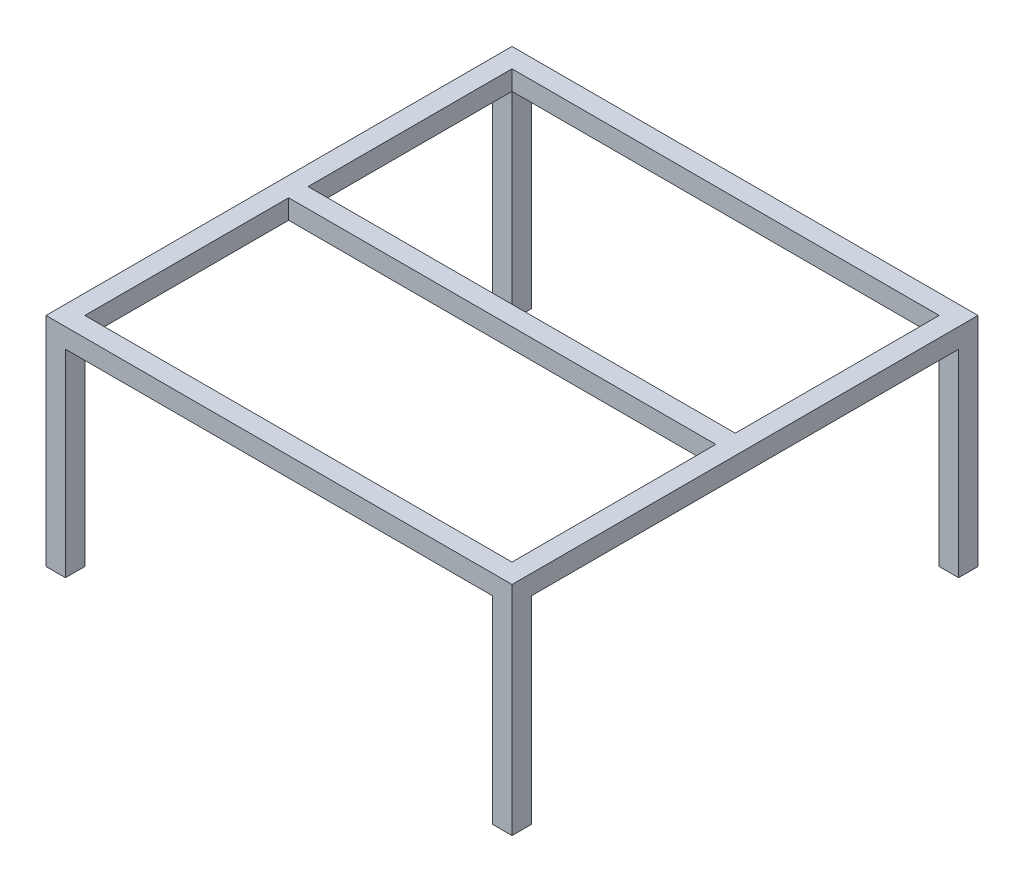
ISO-10303-21;
HEADER;
FILE_DESCRIPTION(('STEP AP214'),'2;1');
FILE_NAME('part.step','',(''),(''),'','','');
FILE_SCHEMA(('AUTOMOTIVE_DESIGN { 1 0 10303 214 1 1 1 1 }'));
ENDSEC;
DATA;
#1=APPLICATION_CONTEXT('core data for automotive mechanical design processes');
#2=APPLICATION_PROTOCOL_DEFINITION('international standard','automotive_design',2000,#1);
#3=PRODUCT_CONTEXT('',#1,'mechanical');
#4=PRODUCT('Part','Part','',(#3));
#5=PRODUCT_RELATED_PRODUCT_CATEGORY('part','',(#4));
#6=PRODUCT_DEFINITION_FORMATION('','',#4);
#7=PRODUCT_DEFINITION_CONTEXT('part definition',#1,'design');
#8=PRODUCT_DEFINITION('design','',#6,#7);
#9=PRODUCT_DEFINITION_SHAPE('','',#8);
#10=(LENGTH_UNIT() NAMED_UNIT(*) SI_UNIT(.MILLI.,.METRE.));
#11=(NAMED_UNIT(*) PLANE_ANGLE_UNIT() SI_UNIT($,.RADIAN.));
#12=(NAMED_UNIT(*) SI_UNIT($,.STERADIAN.) SOLID_ANGLE_UNIT());
#13=UNCERTAINTY_MEASURE_WITH_UNIT(LENGTH_MEASURE(1.E-05),#10,'distance_accuracy_value','');
#14=(GEOMETRIC_REPRESENTATION_CONTEXT(3) GLOBAL_UNCERTAINTY_ASSIGNED_CONTEXT((#13)) GLOBAL_UNIT_ASSIGNED_CONTEXT((#10,
#11,#12)) REPRESENTATION_CONTEXT('',''));
#15=CARTESIAN_POINT('',(0.,0.,0.));
#16=DIRECTION('',(0.,0.,1.));
#17=DIRECTION('',(1.,0.,0.));
#18=AXIS2_PLACEMENT_3D('',#15,#16,#17);
#19=CARTESIAN_POINT('',(0.,11.43,0.));
#20=DIRECTION('',(0.,1.,0.));
#21=DIRECTION('',(0.,0.,1.));
#22=AXIS2_PLACEMENT_3D('',#19,#20,#21);
#23=PLANE('',#22);
#24=CARTESIAN_POINT('',(-32.24841603699,11.43,27.6628605629459));
#25=DIRECTION('',(0.,-1.,0.));
#26=DIRECTION('',(0.,0.,-1.));
#27=AXIS2_PLACEMENT_3D('',#24,#25,#26);
#28=CIRCLE('',#27,1.59512);
#29=CARTESIAN_POINT('',(-32.24841603699,11.43,26.067740562946));
#30=VERTEX_POINT('',#29);
#31=EDGE_CURVE('E525',#30,#30,#28,.T.);
#32=ORIENTED_EDGE('',*,*,#31,.F.);
#33=EDGE_LOOP('',(#32));
#34=FACE_BOUND('',#33,.T.);
#35=DIRECTION('',(1.,0.,0.));
#36=VECTOR('',#35,1.);
#37=CARTESIAN_POINT('',(-35.4234160369899,11.43,30.8378605629459));
#38=LINE('',#37,#36);
#39=CARTESIAN_POINT('',(-35.4234160369899,11.43,30.8378605629459));
#40=VERTEX_POINT('',#39);
#41=CARTESIAN_POINT('',(-29.07341603699,11.43,30.8378605629459));
#42=VERTEX_POINT('',#41);
#43=EDGE_CURVE('E414',#40,#42,#38,.T.);
#44=ORIENTED_EDGE('',*,*,#43,.F.);
#45=DIRECTION('',(0.,0.,1.));
#46=VECTOR('',#45,1.);
#47=CARTESIAN_POINT('',(-35.42341603699,11.43,-121.562139437054));
#48=LINE('',#47,#46);
#49=CARTESIAN_POINT('',(-35.4234160369899,11.43,24.4878605629459));
#50=VERTEX_POINT('',#49);
#51=EDGE_CURVE('E398',#50,#40,#48,.T.);
#52=ORIENTED_EDGE('',*,*,#51,.F.);
#53=DIRECTION('',(-1.,0.,0.));
#54=VECTOR('',#53,1.);
#55=CARTESIAN_POINT('',(-35.4234160369899,11.43,24.4878605629459));
#56=LINE('',#55,#54);
#57=CARTESIAN_POINT('',(-29.07341603699,11.43,24.4878605629459));
#58=VERTEX_POINT('',#57);
#59=EDGE_CURVE('E402',#58,#50,#56,.T.);
#60=ORIENTED_EDGE('',*,*,#59,.F.);
#61=DIRECTION('',(0.,0.,-1.));
#62=VECTOR('',#61,1.);
#63=CARTESIAN_POINT('',(-29.07341603699,11.43,30.8378605629459));
#64=LINE('',#63,#62);
#65=EDGE_CURVE('E42',#42,#58,#64,.T.);
#66=ORIENTED_EDGE('',*,*,#65,.F.);
#67=EDGE_LOOP('',(#44,#52,#60,#66));
#68=FACE_BOUND('',#67,.T.);
#69=ADVANCED_FACE('F39',(#34,#68),#23,.F.);
#70=CARTESIAN_POINT('',(113.80158396301,11.43,27.662860562946));
#71=DIRECTION('',(0.,-1.,0.));
#72=DIRECTION('',(0.,0.,-1.));
#73=AXIS2_PLACEMENT_3D('',#70,#71,#72);
#74=CIRCLE('',#73,1.59512);
#75=CARTESIAN_POINT('',(113.80158396301,11.43,26.0677405629459));
#76=VERTEX_POINT('',#75);
#77=EDGE_CURVE('E549',#76,#76,#74,.T.);
#78=ORIENTED_EDGE('',*,*,#77,.F.);
#79=EDGE_LOOP('',(#78));
#80=FACE_BOUND('',#79,.T.);
#81=DIRECTION('',(-1.,0.,0.));
#82=VECTOR('',#81,1.);
#83=CARTESIAN_POINT('',(116.97658396301,11.43,24.487860562946));
#84=LINE('',#83,#82);
#85=CARTESIAN_POINT('',(116.97658396301,11.43,24.487860562946));
#86=VERTEX_POINT('',#85);
#87=CARTESIAN_POINT('',(110.62658396301,11.43,24.487860562946));
#88=VERTEX_POINT('',#87);
#89=EDGE_CURVE('E403',#86,#88,#84,.T.);
#90=ORIENTED_EDGE('',*,*,#89,.F.);
#91=DIRECTION('',(0.,0.,-1.));
#92=VECTOR('',#91,1.);
#93=CARTESIAN_POINT('',(116.97658396301,11.43,-121.562139437054));
#94=LINE('',#93,#92);
#95=CARTESIAN_POINT('',(116.97658396301,11.43,30.8378605629459));
#96=VERTEX_POINT('',#95);
#97=EDGE_CURVE('E407',#96,#86,#94,.T.);
#98=ORIENTED_EDGE('',*,*,#97,.F.);
#99=CARTESIAN_POINT('',(110.62658396301,11.43,30.8378605629459));
#100=VERTEX_POINT('',#99);
#101=EDGE_CURVE('E410',#100,#96,#38,.T.);
#102=ORIENTED_EDGE('',*,*,#101,.F.);
#103=DIRECTION('',(0.,0.,1.));
#104=VECTOR('',#103,1.);
#105=CARTESIAN_POINT('',(110.62658396301,11.43,30.8378605629459));
#106=LINE('',#105,#104);
#107=EDGE_CURVE('E406',#88,#100,#106,.T.);
#108=ORIENTED_EDGE('',*,*,#107,.F.);
#109=EDGE_LOOP('',(#90,#98,#102,#108));
#110=FACE_BOUND('',#109,.T.);
#111=ADVANCED_FACE('F566',(#80,#110),#23,.F.);
#112=CARTESIAN_POINT('',(113.80158396301,11.43,-118.387139437054));
#113=DIRECTION('',(0.,-1.,0.));
#114=DIRECTION('',(0.,0.,-1.));
#115=AXIS2_PLACEMENT_3D('',#112,#113,#114);
#116=CIRCLE('',#115,1.59512);
#117=CARTESIAN_POINT('',(113.80158396301,11.43,-119.982259437054));
#118=VERTEX_POINT('',#117);
#119=EDGE_CURVE('E541',#118,#118,#116,.T.);
#120=ORIENTED_EDGE('',*,*,#119,.F.);
#121=EDGE_LOOP('',(#120));
#122=FACE_BOUND('',#121,.T.);
#123=DIRECTION('',(-1.,0.,0.));
#124=VECTOR('',#123,1.);
#125=CARTESIAN_POINT('',(-35.42341603699,11.43,-121.562139437054));
#126=LINE('',#125,#124);
#127=CARTESIAN_POINT('',(116.97658396301,11.43,-121.562139437054));
#128=VERTEX_POINT('',#127);
#129=CARTESIAN_POINT('',(110.62658396301,11.43,-121.562139437054));
#130=VERTEX_POINT('',#129);
#131=EDGE_CURVE('E393',#128,#130,#126,.T.);
#132=ORIENTED_EDGE('',*,*,#131,.F.);
#133=CARTESIAN_POINT('',(116.97658396301,11.43,-115.212139437054));
#134=VERTEX_POINT('',#133);
#135=EDGE_CURVE('E411',#134,#128,#94,.T.);
#136=ORIENTED_EDGE('',*,*,#135,.F.);
#137=DIRECTION('',(1.,0.,0.));
#138=VECTOR('',#137,1.);
#139=CARTESIAN_POINT('',(116.97658396301,11.43,-115.212139437054));
#140=LINE('',#139,#138);
#141=CARTESIAN_POINT('',(110.62658396301,11.43,-115.212139437054));
#142=VERTEX_POINT('',#141);
#143=EDGE_CURVE('E397',#142,#134,#140,.T.);
#144=ORIENTED_EDGE('',*,*,#143,.F.);
#145=DIRECTION('',(0.,0.,1.));
#146=VECTOR('',#145,1.);
#147=CARTESIAN_POINT('',(110.62658396301,11.43,30.8378605629459));
#148=LINE('',#147,#146);
#149=EDGE_CURVE('E11',#130,#142,#148,.T.);
#150=ORIENTED_EDGE('',*,*,#149,.F.);
#151=EDGE_LOOP('',(#132,#136,#144,#150));
#152=FACE_BOUND('',#151,.T.);
#153=ADVANCED_FACE('F569',(#122,#152),#23,.F.);
#154=CARTESIAN_POINT('',(-32.24841603699,11.43,-118.387139437054));
#155=DIRECTION('',(0.,-1.,0.));
#156=DIRECTION('',(0.,0.,-1.));
#157=AXIS2_PLACEMENT_3D('',#154,#155,#156);
#158=CIRCLE('',#157,1.59512);
#159=CARTESIAN_POINT('',(-32.24841603699,11.43,-119.982259437054));
#160=VERTEX_POINT('',#159);
#161=EDGE_CURVE('E533',#160,#160,#158,.T.);
#162=ORIENTED_EDGE('',*,*,#161,.F.);
#163=EDGE_LOOP('',(#162));
#164=FACE_BOUND('',#163,.T.);
#165=DIRECTION('',(1.,0.,0.));
#166=VECTOR('',#165,1.);
#167=CARTESIAN_POINT('',(-35.42341603699,11.43,-115.212139437054));
#168=LINE('',#167,#166);
#169=CARTESIAN_POINT('',(-35.42341603699,11.43,-115.212139437054));
#170=VERTEX_POINT('',#169);
#171=CARTESIAN_POINT('',(-29.07341603699,11.43,-115.212139437054));
#172=VERTEX_POINT('',#171);
#173=EDGE_CURVE('E399',#170,#172,#168,.T.);
#174=ORIENTED_EDGE('',*,*,#173,.F.);
#175=CARTESIAN_POINT('',(-35.42341603699,11.43,-121.562139437054));
#176=VERTEX_POINT('',#175);
#177=EDGE_CURVE('E394',#176,#170,#48,.T.);
#178=ORIENTED_EDGE('',*,*,#177,.F.);
#179=CARTESIAN_POINT('',(-29.07341603699,11.43,-121.562139437054));
#180=VERTEX_POINT('',#179);
#181=EDGE_CURVE('E390',#180,#176,#126,.T.);
#182=ORIENTED_EDGE('',*,*,#181,.F.);
#183=DIRECTION('',(0.,0.,-1.));
#184=VECTOR('',#183,1.);
#185=CARTESIAN_POINT('',(-29.07341603699,11.43,30.8378605629459));
#186=LINE('',#185,#184);
#187=EDGE_CURVE('E48',#172,#180,#186,.T.);
#188=ORIENTED_EDGE('',*,*,#187,.F.);
#189=EDGE_LOOP('',(#174,#178,#182,#188));
#190=FACE_BOUND('',#189,.T.);
#191=ADVANCED_FACE('F577',(#164,#190),#23,.F.);
#192=CARTESIAN_POINT('',(-29.07341603699,82.55,30.8378605629459));
#193=DIRECTION('',(-1.,0.,0.));
#194=DIRECTION('',(0.,0.,1.));
#195=AXIS2_PLACEMENT_3D('',#192,#193,#194);
#196=PLANE('',#195);
#197=DIRECTION('',(0.,1.,0.));
#198=VECTOR('',#197,1.);
#199=CARTESIAN_POINT('',(-29.07341603699,82.55,-48.5220858432598));
#200=LINE('',#199,#198);
#201=CARTESIAN_POINT('',(-29.07341603699,76.1659043542835,-48.5220858432598));
#202=VERTEX_POINT('',#201);
#203=CARTESIAN_POINT('',(-29.07341603699,82.55,-48.5220858432598));
#204=VERTEX_POINT('',#203);
#205=EDGE_CURVE('E213',#202,#204,#200,.T.);
#206=ORIENTED_EDGE('',*,*,#205,.F.);
#207=DIRECTION('',(0.,0.,1.));
#208=VECTOR('',#207,1.);
#209=CARTESIAN_POINT('',(-29.07341603699,76.1659043542835,-115.212139437054));
#210=LINE('',#209,#208);
#211=CARTESIAN_POINT('',(-29.07341603699,76.1659043542835,-115.212139437054));
#212=VERTEX_POINT('',#211);
#213=EDGE_CURVE('E289',#212,#202,#210,.T.);
#214=ORIENTED_EDGE('',*,*,#213,.F.);
#215=DIRECTION('',(0.,-1.,0.));
#216=VECTOR('',#215,1.);
#217=CARTESIAN_POINT('',(-29.07341603699,82.55,-115.212139437054));
#218=LINE('',#217,#216);
#219=CARTESIAN_POINT('',(-29.07341603699,82.55,-115.212139437054));
#220=VERTEX_POINT('',#219);
#221=EDGE_CURVE('E219',#220,#212,#218,.T.);
#222=ORIENTED_EDGE('',*,*,#221,.F.);
#223=DIRECTION('',(0.,0.,-1.));
#224=VECTOR('',#223,1.);
#225=CARTESIAN_POINT('',(-29.07341603699,82.55,30.8378605629459));
#226=LINE('',#225,#224);
#227=EDGE_CURVE('E334',#204,#220,#226,.T.);
#228=ORIENTED_EDGE('',*,*,#227,.F.);
#229=EDGE_LOOP('',(#206,#214,#222,#228));
#230=FACE_BOUND('',#229,.T.);
#231=ADVANCED_FACE('F512',(#230),#196,.F.);
#232=CARTESIAN_POINT('',(110.62658396301,82.55,-48.5220858432598));
#233=DIRECTION('',(0.,0.,1.));
#234=DIRECTION('',(1.,0.,0.));
#235=AXIS2_PLACEMENT_3D('',#232,#233,#234);
#236=PLANE('',#235);
#237=ORIENTED_EDGE('',*,*,#205,.T.);
#238=DIRECTION('',(-1.,0.,0.));
#239=VECTOR('',#238,1.);
#240=CARTESIAN_POINT('',(110.62658396301,82.55,-48.5220858432598));
#241=LINE('',#240,#239);
#242=CARTESIAN_POINT('',(110.62658396301,82.55,-48.5220858432598));
#243=VERTEX_POINT('',#242);
#244=EDGE_CURVE('E226',#243,#204,#241,.T.);
#245=ORIENTED_EDGE('',*,*,#244,.F.);
#246=DIRECTION('',(0.,1.,0.));
#247=VECTOR('',#246,1.);
#248=CARTESIAN_POINT('',(110.62658396301,82.55,-48.5220858432598));
#249=LINE('',#248,#247);
#250=CARTESIAN_POINT('',(110.62658396301,76.1659043542835,-48.5220858432598));
#251=VERTEX_POINT('',#250);
#252=EDGE_CURVE('E212',#251,#243,#249,.T.);
#253=ORIENTED_EDGE('',*,*,#252,.F.);
#254=DIRECTION('',(-1.,0.,0.));
#255=VECTOR('',#254,1.);
#256=CARTESIAN_POINT('',(110.62658396301,76.1659043542835,-48.5220858432598));
#257=LINE('',#256,#255);
#258=EDGE_CURVE('E220',#251,#202,#257,.T.);
#259=ORIENTED_EDGE('',*,*,#258,.T.);
#260=EDGE_LOOP('',(#237,#245,#253,#259));
#261=FACE_BOUND('',#260,.T.);
#262=ADVANCED_FACE('F584',(#261),#236,.F.);
#263=CARTESIAN_POINT('',(110.62658396301,82.55,30.8378605629459));
#264=DIRECTION('',(1.,0.,0.));
#265=DIRECTION('',(0.,0.,-1.));
#266=AXIS2_PLACEMENT_3D('',#263,#264,#265);
#267=PLANE('',#266);
#268=ORIENTED_EDGE('',*,*,#252,.T.);
#269=DIRECTION('',(0.,0.,1.));
#270=VECTOR('',#269,1.);
#271=CARTESIAN_POINT('',(110.62658396301,82.55,30.8378605629459));
#272=LINE('',#271,#270);
#273=CARTESIAN_POINT('',(110.62658396301,82.55,-115.212139437054));
#274=VERTEX_POINT('',#273);
#275=EDGE_CURVE('E354',#274,#243,#272,.T.);
#276=ORIENTED_EDGE('',*,*,#275,.F.);
#277=DIRECTION('',(0.,-1.,0.));
#278=VECTOR('',#277,1.);
#279=CARTESIAN_POINT('',(110.62658396301,82.55,-115.212139437054));
#280=LINE('',#279,#278);
#281=CARTESIAN_POINT('',(110.62658396301,76.1659043542835,-115.212139437054));
#282=VERTEX_POINT('',#281);
#283=EDGE_CURVE('E230',#274,#282,#280,.T.);
#284=ORIENTED_EDGE('',*,*,#283,.T.);
#285=DIRECTION('',(0.,0.,1.));
#286=VECTOR('',#285,1.);
#287=CARTESIAN_POINT('',(110.62658396301,76.1659043542835,-115.212139437054));
#288=LINE('',#287,#286);
#289=EDGE_CURVE('E202',#282,#251,#288,.T.);
#290=ORIENTED_EDGE('',*,*,#289,.T.);
#291=EDGE_LOOP('',(#268,#276,#284,#290));
#292=FACE_BOUND('',#291,.T.);
#293=ADVANCED_FACE('F460',(#292),#267,.F.);
#294=DIRECTION('',(0.,-1.,0.));
#295=VECTOR('',#294,1.);
#296=CARTESIAN_POINT('',(-29.07341603699,82.55,-42.1720858432598));
#297=LINE('',#296,#295);
#298=CARTESIAN_POINT('',(-29.07341603699,82.55,-42.1720858432598));
#299=VERTEX_POINT('',#298);
#300=CARTESIAN_POINT('',(-29.07341603699,76.1659043542835,-42.1720858432598));
#301=VERTEX_POINT('',#300);
#302=EDGE_CURVE('E217',#299,#301,#297,.T.);
#303=ORIENTED_EDGE('',*,*,#302,.F.);
#304=CARTESIAN_POINT('',(-29.07341603699,82.55,24.487860562946));
#305=VERTEX_POINT('',#304);
#306=EDGE_CURVE('E335',#305,#299,#226,.T.);
#307=ORIENTED_EDGE('',*,*,#306,.F.);
#308=DIRECTION('',(0.,1.,0.));
#309=VECTOR('',#308,1.);
#310=CARTESIAN_POINT('',(-29.07341603699,82.55,24.487860562946));
#311=LINE('',#310,#309);
#312=CARTESIAN_POINT('',(-29.07341603699,76.1659043542835,24.487860562946));
#313=VERTEX_POINT('',#312);
#314=EDGE_CURVE('E258',#313,#305,#311,.T.);
#315=ORIENTED_EDGE('',*,*,#314,.F.);
#316=EDGE_CURVE('E288',#301,#313,#210,.T.);
#317=ORIENTED_EDGE('',*,*,#316,.F.);
#318=EDGE_LOOP('',(#303,#307,#315,#317));
#319=FACE_BOUND('',#318,.T.);
#320=ADVANCED_FACE('F496',(#319),#196,.F.);
#321=CARTESIAN_POINT('',(110.62658396301,82.55,24.487860562946));
#322=DIRECTION('',(0.,0.,1.));
#323=DIRECTION('',(1.,0.,0.));
#324=AXIS2_PLACEMENT_3D('',#321,#322,#323);
#325=PLANE('',#324);
#326=ORIENTED_EDGE('',*,*,#314,.T.);
#327=DIRECTION('',(-1.,0.,0.));
#328=VECTOR('',#327,1.);
#329=CARTESIAN_POINT('',(110.62658396301,82.55,24.487860562946));
#330=LINE('',#329,#328);
#331=CARTESIAN_POINT('',(110.62658396301,82.55,24.487860562946));
#332=VERTEX_POINT('',#331);
#333=EDGE_CURVE('E261',#332,#305,#330,.T.);
#334=ORIENTED_EDGE('',*,*,#333,.F.);
#335=DIRECTION('',(0.,1.,0.));
#336=VECTOR('',#335,1.);
#337=CARTESIAN_POINT('',(110.62658396301,82.55,24.487860562946));
#338=LINE('',#337,#336);
#339=CARTESIAN_POINT('',(110.62658396301,76.1659043542835,24.487860562946));
#340=VERTEX_POINT('',#339);
#341=EDGE_CURVE('E257',#340,#332,#338,.T.);
#342=ORIENTED_EDGE('',*,*,#341,.F.);
#343=DIRECTION('',(-1.,0.,0.));
#344=VECTOR('',#343,1.);
#345=CARTESIAN_POINT('',(110.62658396301,76.1659043542835,24.487860562946));
#346=LINE('',#345,#344);
#347=EDGE_CURVE('E270',#340,#313,#346,.T.);
#348=ORIENTED_EDGE('',*,*,#347,.T.);
#349=EDGE_LOOP('',(#326,#334,#342,#348));
#350=FACE_BOUND('',#349,.T.);
#351=ADVANCED_FACE('F492',(#350),#325,.F.);
#352=DIRECTION('',(0.,-1.,0.));
#353=VECTOR('',#352,1.);
#354=CARTESIAN_POINT('',(110.62658396301,82.55,-42.1720858432598));
#355=LINE('',#354,#353);
#356=CARTESIAN_POINT('',(110.62658396301,82.55,-42.1720858432598));
#357=VERTEX_POINT('',#356);
#358=CARTESIAN_POINT('',(110.62658396301,76.1659043542835,-42.1720858432598));
#359=VERTEX_POINT('',#358);
#360=EDGE_CURVE('E206',#357,#359,#355,.T.);
#361=ORIENTED_EDGE('',*,*,#360,.T.);
#362=EDGE_CURVE('E189',#359,#340,#288,.T.);
#363=ORIENTED_EDGE('',*,*,#362,.T.);
#364=ORIENTED_EDGE('',*,*,#341,.T.);
#365=EDGE_CURVE('E208',#357,#332,#272,.T.);
#366=ORIENTED_EDGE('',*,*,#365,.F.);
#367=EDGE_LOOP('',(#361,#363,#364,#366));
#368=FACE_BOUND('',#367,.T.);
#369=ADVANCED_FACE('F207',(#368),#267,.F.);
#370=CARTESIAN_POINT('',(110.62658396301,82.55,-42.1720858432598));
#371=DIRECTION('',(0.,0.,-1.));
#372=DIRECTION('',(0.,1.,0.));
#373=AXIS2_PLACEMENT_3D('',#370,#371,#372);
#374=PLANE('',#373);
#375=ORIENTED_EDGE('',*,*,#302,.T.);
#376=DIRECTION('',(-1.,0.,0.));
#377=VECTOR('',#376,1.);
#378=CARTESIAN_POINT('',(110.62658396301,76.1659043542835,-42.1720858432598));
#379=LINE('',#378,#377);
#380=EDGE_CURVE('E193',#359,#301,#379,.T.);
#381=ORIENTED_EDGE('',*,*,#380,.F.);
#382=ORIENTED_EDGE('',*,*,#360,.F.);
#383=DIRECTION('',(-1.,0.,0.));
#384=VECTOR('',#383,1.);
#385=CARTESIAN_POINT('',(110.62658396301,82.55,-42.1720858432598));
#386=LINE('',#385,#384);
#387=EDGE_CURVE('E500',#357,#299,#386,.T.);
#388=ORIENTED_EDGE('',*,*,#387,.T.);
#389=EDGE_LOOP('',(#375,#381,#382,#388));
#390=FACE_BOUND('',#389,.T.);
#391=ADVANCED_FACE('F215',(#390),#374,.F.);
#392=CARTESIAN_POINT('',(110.62658396301,82.55,-115.212139437054));
#393=DIRECTION('',(0.,0.,-1.));
#394=DIRECTION('',(-1.,0.,0.));
#395=AXIS2_PLACEMENT_3D('',#392,#393,#394);
#396=PLANE('',#395);
#397=ORIENTED_EDGE('',*,*,#221,.T.);
#398=DIRECTION('',(-1.,0.,0.));
#399=VECTOR('',#398,1.);
#400=CARTESIAN_POINT('',(110.62658396301,76.1659043542835,-115.212139437054));
#401=LINE('',#400,#399);
#402=EDGE_CURVE('E244',#282,#212,#401,.T.);
#403=ORIENTED_EDGE('',*,*,#402,.F.);
#404=ORIENTED_EDGE('',*,*,#283,.F.);
#405=DIRECTION('',(-1.,0.,0.));
#406=VECTOR('',#405,1.);
#407=CARTESIAN_POINT('',(110.62658396301,82.55,-115.212139437054));
#408=LINE('',#407,#406);
#409=EDGE_CURVE('E248',#274,#220,#408,.T.);
#410=ORIENTED_EDGE('',*,*,#409,.T.);
#411=EDGE_LOOP('',(#397,#403,#404,#410));
#412=FACE_BOUND('',#411,.T.);
#413=ADVANCED_FACE('F511',(#412),#396,.F.);
#414=CARTESIAN_POINT('',(-35.4234160369899,82.55,24.4878605629459));
#415=DIRECTION('',(0.,0.,1.));
#416=DIRECTION('',(1.,0.,0.));
#417=AXIS2_PLACEMENT_3D('',#414,#415,#416);
#418=PLANE('',#417);
#419=DIRECTION('',(0.,-1.,0.));
#420=VECTOR('',#419,1.);
#421=CARTESIAN_POINT('',(-29.07341603699,82.55,24.4878605629459));
#422=LINE('',#421,#420);
#423=EDGE_CURVE('E343',#313,#58,#422,.T.);
#424=ORIENTED_EDGE('',*,*,#423,.T.);
#425=ORIENTED_EDGE('',*,*,#59,.T.);
#426=DIRECTION('',(0.,-1.,0.));
#427=VECTOR('',#426,1.);
#428=CARTESIAN_POINT('',(-35.4234160369899,82.55,24.4878605629459));
#429=LINE('',#428,#427);
#430=CARTESIAN_POINT('',(-35.4234160369899,76.1659043542835,24.487860562946));
#431=VERTEX_POINT('',#430);
#432=EDGE_CURVE('E339',#431,#50,#429,.T.);
#433=ORIENTED_EDGE('',*,*,#432,.F.);
#434=DIRECTION('',(-1.,0.,0.));
#435=VECTOR('',#434,1.);
#436=CARTESIAN_POINT('',(-29.07341603699,76.1659043542835,24.487860562946));
#437=LINE('',#436,#435);
#438=EDGE_CURVE('E277',#313,#431,#437,.T.);
#439=ORIENTED_EDGE('',*,*,#438,.F.);
#440=EDGE_LOOP('',(#424,#425,#433,#439));
#441=FACE_BOUND('',#440,.T.);
#442=ADVANCED_FACE('F427',(#441),#418,.F.);
#443=CARTESIAN_POINT('',(-35.42341603699,82.55,-115.212139437054));
#444=DIRECTION('',(0.,0.,-1.));
#445=DIRECTION('',(-1.,0.,0.));
#446=AXIS2_PLACEMENT_3D('',#443,#444,#445);
#447=PLANE('',#446);
#448=DIRECTION('',(0.,-1.,0.));
#449=VECTOR('',#448,1.);
#450=CARTESIAN_POINT('',(-35.42341603699,82.55,-115.212139437054));
#451=LINE('',#450,#449);
#452=CARTESIAN_POINT('',(-35.4234160369899,76.1659043542835,-115.212139437054));
#453=VERTEX_POINT('',#452);
#454=EDGE_CURVE('E326',#453,#170,#451,.T.);
#455=ORIENTED_EDGE('',*,*,#454,.T.);
#456=ORIENTED_EDGE('',*,*,#173,.T.);
#457=DIRECTION('',(0.,-1.,0.));
#458=VECTOR('',#457,1.);
#459=CARTESIAN_POINT('',(-29.07341603699,82.55,-115.212139437054));
#460=LINE('',#459,#458);
#461=EDGE_CURVE('E322',#212,#172,#460,.T.);
#462=ORIENTED_EDGE('',*,*,#461,.F.);
#463=DIRECTION('',(-1.,0.,0.));
#464=VECTOR('',#463,1.);
#465=CARTESIAN_POINT('',(-29.07341603699,76.1659043542835,-115.212139437054));
#466=LINE('',#465,#464);
#467=EDGE_CURVE('E278',#212,#453,#466,.T.);
#468=ORIENTED_EDGE('',*,*,#467,.T.);
#469=EDGE_LOOP('',(#455,#456,#462,#468));
#470=FACE_BOUND('',#469,.T.);
#471=ADVANCED_FACE('F440',(#470),#447,.F.);
#472=DIRECTION('',(0.,-1.,0.));
#473=VECTOR('',#472,1.);
#474=CARTESIAN_POINT('',(110.62658396301,82.55,24.487860562946));
#475=LINE('',#474,#473);
#476=EDGE_CURVE('E366',#340,#88,#475,.T.);
#477=ORIENTED_EDGE('',*,*,#476,.T.);
#478=ORIENTED_EDGE('',*,*,#107,.T.);
#479=DIRECTION('',(0.,-1.,0.));
#480=VECTOR('',#479,1.);
#481=CARTESIAN_POINT('',(110.62658396301,82.55,30.8378605629459));
#482=LINE('',#481,#480);
#483=CARTESIAN_POINT('',(110.62658396301,76.1659043542835,30.8378605629459));
#484=VERTEX_POINT('',#483);
#485=EDGE_CURVE('E362',#484,#100,#482,.T.);
#486=ORIENTED_EDGE('',*,*,#485,.F.);
#487=DIRECTION('',(0.,0.,-1.));
#488=VECTOR('',#487,1.);
#489=CARTESIAN_POINT('',(110.62658396301,76.1659043542835,30.8378605629459));
#490=LINE('',#489,#488);
#491=EDGE_CURVE('E253',#484,#340,#490,.T.);
#492=ORIENTED_EDGE('',*,*,#491,.T.);
#493=EDGE_LOOP('',(#477,#478,#486,#492));
#494=FACE_BOUND('',#493,.T.);
#495=ADVANCED_FACE('F478',(#494),#267,.F.);
#496=CARTESIAN_POINT('',(110.62658396301,76.1659043542835,30.8378605629459));
#497=DIRECTION('',(0.,1.,0.));
#498=DIRECTION('',(0.,0.,1.));
#499=AXIS2_PLACEMENT_3D('',#496,#497,#498);
#500=PLANE('',#499);
#501=DIRECTION('',(0.,0.,-1.));
#502=VECTOR('',#501,1.);
#503=CARTESIAN_POINT('',(-29.07341603699,76.1659043542835,30.8378605629459));
#504=LINE('',#503,#502);
#505=CARTESIAN_POINT('',(-29.07341603699,76.1659043542835,30.8378605629459));
#506=VERTEX_POINT('',#505);
#507=EDGE_CURVE('E252',#506,#313,#504,.T.);
#508=ORIENTED_EDGE('',*,*,#507,.T.);
#509=ORIENTED_EDGE('',*,*,#347,.F.);
#510=ORIENTED_EDGE('',*,*,#491,.F.);
#511=DIRECTION('',(-1.,0.,0.));
#512=VECTOR('',#511,1.);
#513=CARTESIAN_POINT('',(110.62658396301,76.1659043542835,30.8378605629459));
#514=LINE('',#513,#512);
#515=EDGE_CURVE('E274',#484,#506,#514,.T.);
#516=ORIENTED_EDGE('',*,*,#515,.T.);
#517=EDGE_LOOP('',(#508,#509,#510,#516));
#518=FACE_BOUND('',#517,.T.);
#519=ADVANCED_FACE('F483',(#518),#500,.F.);
#520=DIRECTION('',(0.,-1.,0.));
#521=VECTOR('',#520,1.);
#522=CARTESIAN_POINT('',(-29.07341603699,82.55,30.8378605629459));
#523=LINE('',#522,#521);
#524=EDGE_CURVE('E347',#506,#42,#523,.T.);
#525=ORIENTED_EDGE('',*,*,#524,.T.);
#526=ORIENTED_EDGE('',*,*,#65,.T.);
#527=ORIENTED_EDGE('',*,*,#423,.F.);
#528=ORIENTED_EDGE('',*,*,#507,.F.);
#529=EDGE_LOOP('',(#525,#526,#527,#528));
#530=FACE_BOUND('',#529,.T.);
#531=ADVANCED_FACE('F489',(#530),#196,.F.);
#532=CARTESIAN_POINT('',(116.97658396301,82.55,-115.212139437054));
#533=DIRECTION('',(0.,0.,-1.));
#534=DIRECTION('',(-1.,0.,0.));
#535=AXIS2_PLACEMENT_3D('',#532,#533,#534);
#536=PLANE('',#535);
#537=DIRECTION('',(0.,-1.,0.));
#538=VECTOR('',#537,1.);
#539=CARTESIAN_POINT('',(110.62658396301,82.55,-115.212139437054));
#540=LINE('',#539,#538);
#541=EDGE_CURVE('E306',#282,#142,#540,.T.);
#542=ORIENTED_EDGE('',*,*,#541,.T.);
#543=ORIENTED_EDGE('',*,*,#143,.T.);
#544=DIRECTION('',(0.,-1.,0.));
#545=VECTOR('',#544,1.);
#546=CARTESIAN_POINT('',(116.97658396301,82.55,-115.212139437054));
#547=LINE('',#546,#545);
#548=CARTESIAN_POINT('',(116.97658396301,76.1659043542835,-115.212139437054));
#549=VERTEX_POINT('',#548);
#550=EDGE_CURVE('E302',#549,#134,#547,.T.);
#551=ORIENTED_EDGE('',*,*,#550,.F.);
#552=DIRECTION('',(-1.,0.,0.));
#553=VECTOR('',#552,1.);
#554=CARTESIAN_POINT('',(110.62658396301,76.1659043542835,-115.212139437054));
#555=LINE('',#554,#553);
#556=EDGE_CURVE('E203',#549,#282,#555,.T.);
#557=ORIENTED_EDGE('',*,*,#556,.T.);
#558=EDGE_LOOP('',(#542,#543,#551,#557));
#559=FACE_BOUND('',#558,.T.);
#560=ADVANCED_FACE('F468',(#559),#536,.F.);
#561=CARTESIAN_POINT('',(110.62658396301,76.1659043542835,-115.212139437054));
#562=DIRECTION('',(0.,1.,0.));
#563=DIRECTION('',(0.,0.,1.));
#564=AXIS2_PLACEMENT_3D('',#561,#562,#563);
#565=PLANE('',#564);
#566=DIRECTION('',(-1.,0.,0.));
#567=VECTOR('',#566,1.);
#568=CARTESIAN_POINT('',(110.62658396301,76.1659043542835,24.487860562946));
#569=LINE('',#568,#567);
#570=CARTESIAN_POINT('',(116.97658396301,76.1659043542835,24.487860562946));
#571=VERTEX_POINT('',#570);
#572=EDGE_CURVE('E196',#571,#340,#569,.T.);
#573=ORIENTED_EDGE('',*,*,#572,.T.);
#574=ORIENTED_EDGE('',*,*,#362,.F.);
#575=ORIENTED_EDGE('',*,*,#380,.T.);
#576=ORIENTED_EDGE('',*,*,#316,.T.);
#577=ORIENTED_EDGE('',*,*,#438,.T.);
#578=DIRECTION('',(0.,0.,1.));
#579=VECTOR('',#578,1.);
#580=CARTESIAN_POINT('',(-35.4234160369899,76.1659043542835,-115.212139437054));
#581=LINE('',#580,#579);
#582=EDGE_CURVE('E282',#453,#431,#581,.T.);
#583=ORIENTED_EDGE('',*,*,#582,.F.);
#584=ORIENTED_EDGE('',*,*,#467,.F.);
#585=ORIENTED_EDGE('',*,*,#213,.T.);
#586=ORIENTED_EDGE('',*,*,#258,.F.);
#587=ORIENTED_EDGE('',*,*,#289,.F.);
#588=ORIENTED_EDGE('',*,*,#556,.F.);
#589=DIRECTION('',(0.,0.,1.));
#590=VECTOR('',#589,1.);
#591=CARTESIAN_POINT('',(116.97658396301,76.1659043542835,-115.212139437054));
#592=LINE('',#591,#590);
#593=EDGE_CURVE('E299',#549,#571,#592,.T.);
#594=ORIENTED_EDGE('',*,*,#593,.T.);
#595=EDGE_LOOP('',(#573,#574,#575,#576,#577,#583,#584,#585,#586,#587,#588,#594));
#596=FACE_BOUND('',#595,.T.);
#597=ADVANCED_FACE('F191',(#596),#565,.F.);
#598=CARTESIAN_POINT('',(116.97658396301,82.55,24.487860562946));
#599=DIRECTION('',(0.,0.,1.));
#600=DIRECTION('',(1.,0.,0.));
#601=AXIS2_PLACEMENT_3D('',#598,#599,#600);
#602=PLANE('',#601);
#603=DIRECTION('',(0.,-1.,0.));
#604=VECTOR('',#603,1.);
#605=CARTESIAN_POINT('',(116.97658396301,82.55,24.487860562946));
#606=LINE('',#605,#604);
#607=EDGE_CURVE('E370',#571,#86,#606,.T.);
#608=ORIENTED_EDGE('',*,*,#607,.T.);
#609=ORIENTED_EDGE('',*,*,#89,.T.);
#610=ORIENTED_EDGE('',*,*,#476,.F.);
#611=ORIENTED_EDGE('',*,*,#572,.F.);
#612=EDGE_LOOP('',(#608,#609,#610,#611));
#613=FACE_BOUND('',#612,.T.);
#614=ADVANCED_FACE('F475',(#613),#602,.F.);
#615=CARTESIAN_POINT('',(-35.4234160369899,6.34999999999999,30.8378605629459));
#616=DIRECTION('',(0.,0.,-1.));
#617=DIRECTION('',(-1.,0.,0.));
#618=AXIS2_PLACEMENT_3D('',#615,#616,#617);
#619=PLANE('',#618);
#620=DIRECTION('',(0.,-1.,0.));
#621=VECTOR('',#620,1.);
#622=CARTESIAN_POINT('',(-35.4234160369899,6.34999999999999,30.8378605629459));
#623=LINE('',#622,#621);
#624=CARTESIAN_POINT('',(-35.4234160369899,82.55,30.8378605629459));
#625=VERTEX_POINT('',#624);
#626=EDGE_CURVE('E386',#625,#40,#623,.T.);
#627=ORIENTED_EDGE('',*,*,#626,.T.);
#628=ORIENTED_EDGE('',*,*,#43,.T.);
#629=ORIENTED_EDGE('',*,*,#524,.F.);
#630=ORIENTED_EDGE('',*,*,#515,.F.);
#631=ORIENTED_EDGE('',*,*,#485,.T.);
#632=ORIENTED_EDGE('',*,*,#101,.T.);
#633=DIRECTION('',(0.,-1.,0.));
#634=VECTOR('',#633,1.);
#635=CARTESIAN_POINT('',(116.97658396301,6.34999999999999,30.8378605629459));
#636=LINE('',#635,#634);
#637=CARTESIAN_POINT('',(116.97658396301,82.55,30.8378605629459));
#638=VERTEX_POINT('',#637);
#639=EDGE_CURVE('E382',#638,#96,#636,.T.);
#640=ORIENTED_EDGE('',*,*,#639,.F.);
#641=DIRECTION('',(1.,0.,0.));
#642=VECTOR('',#641,1.);
#643=CARTESIAN_POINT('',(116.97658396301,82.55,30.8378605629459));
#644=LINE('',#643,#642);
#645=EDGE_CURVE('E358',#625,#638,#644,.T.);
#646=ORIENTED_EDGE('',*,*,#645,.F.);
#647=EDGE_LOOP('',(#627,#628,#629,#630,#631,#632,#640,#646));
#648=FACE_BOUND('',#647,.T.);
#649=ADVANCED_FACE('F488',(#648),#619,.F.);
#650=CARTESIAN_POINT('',(0.,82.55,0.));
#651=DIRECTION('',(0.,1.,0.));
#652=DIRECTION('',(0.,0.,1.));
#653=AXIS2_PLACEMENT_3D('',#650,#651,#652);
#654=PLANE('',#653);
#655=ORIENTED_EDGE('',*,*,#387,.F.);
#656=ORIENTED_EDGE('',*,*,#365,.T.);
#657=ORIENTED_EDGE('',*,*,#333,.T.);
#658=ORIENTED_EDGE('',*,*,#306,.T.);
#659=EDGE_LOOP('',(#655,#656,#657,#658));
#660=FACE_BOUND('',#659,.T.);
#661=ORIENTED_EDGE('',*,*,#409,.F.);
#662=ORIENTED_EDGE('',*,*,#275,.T.);
#663=ORIENTED_EDGE('',*,*,#244,.T.);
#664=ORIENTED_EDGE('',*,*,#227,.T.);
#665=EDGE_LOOP('',(#661,#662,#663,#664));
#666=FACE_BOUND('',#665,.T.);
#667=DIRECTION('',(0.,0.,-1.));
#668=VECTOR('',#667,1.);
#669=CARTESIAN_POINT('',(116.97658396301,82.55,30.8378605629459));
#670=LINE('',#669,#668);
#671=CARTESIAN_POINT('',(116.97658396301,82.55,-121.562139437054));
#672=VERTEX_POINT('',#671);
#673=EDGE_CURVE('E350',#638,#672,#670,.T.);
#674=ORIENTED_EDGE('',*,*,#673,.T.);
#675=DIRECTION('',(-1.,0.,0.));
#676=VECTOR('',#675,1.);
#677=CARTESIAN_POINT('',(-35.42341603699,82.55,-121.562139437054));
#678=LINE('',#677,#676);
#679=CARTESIAN_POINT('',(-35.42341603699,82.55,-121.562139437054));
#680=VERTEX_POINT('',#679);
#681=EDGE_CURVE('E314',#672,#680,#678,.T.);
#682=ORIENTED_EDGE('',*,*,#681,.T.);
#683=DIRECTION('',(0.,0.,1.));
#684=VECTOR('',#683,1.);
#685=CARTESIAN_POINT('',(-35.4234160369899,82.55,30.8378605629459));
#686=LINE('',#685,#684);
#687=EDGE_CURVE('E330',#680,#625,#686,.T.);
#688=ORIENTED_EDGE('',*,*,#687,.T.);
#689=ORIENTED_EDGE('',*,*,#645,.T.);
#690=EDGE_LOOP('',(#674,#682,#688,#689));
#691=FACE_BOUND('',#690,.T.);
#692=ADVANCED_FACE('F498',(#660,#666,#691),#654,.T.);
#693=CARTESIAN_POINT('',(-35.42341603699,6.34999999999999,-121.562139437054));
#694=DIRECTION('',(1.,0.,0.));
#695=DIRECTION('',(0.,0.,-1.));
#696=AXIS2_PLACEMENT_3D('',#693,#694,#695);
#697=PLANE('',#696);
#698=DIRECTION('',(0.,-1.,0.));
#699=VECTOR('',#698,1.);
#700=CARTESIAN_POINT('',(-35.42341603699,6.34999999999999,-121.562139437054));
#701=LINE('',#700,#699);
#702=EDGE_CURVE('E374',#680,#176,#701,.T.);
#703=ORIENTED_EDGE('',*,*,#702,.T.);
#704=ORIENTED_EDGE('',*,*,#177,.T.);
#705=ORIENTED_EDGE('',*,*,#454,.F.);
#706=ORIENTED_EDGE('',*,*,#582,.T.);
#707=ORIENTED_EDGE('',*,*,#432,.T.);
#708=ORIENTED_EDGE('',*,*,#51,.T.);
#709=ORIENTED_EDGE('',*,*,#626,.F.);
#710=ORIENTED_EDGE('',*,*,#687,.F.);
#711=EDGE_LOOP('',(#703,#704,#705,#706,#707,#708,#709,#710));
#712=FACE_BOUND('',#711,.T.);
#713=ADVANCED_FACE('F434',(#712),#697,.F.);
#714=ORIENTED_EDGE('',*,*,#461,.T.);
#715=ORIENTED_EDGE('',*,*,#187,.T.);
#716=DIRECTION('',(0.,-1.,0.));
#717=VECTOR('',#716,1.);
#718=CARTESIAN_POINT('',(-29.07341603699,82.55,-121.562139437054));
#719=LINE('',#718,#717);
#720=CARTESIAN_POINT('',(-29.07341603699,76.1659043542835,-121.562139437054));
#721=VERTEX_POINT('',#720);
#722=EDGE_CURVE('E318',#721,#180,#719,.T.);
#723=ORIENTED_EDGE('',*,*,#722,.F.);
#724=DIRECTION('',(0.,0.,-1.));
#725=VECTOR('',#724,1.);
#726=CARTESIAN_POINT('',(-29.07341603699,76.1659043542835,-121.562139437054));
#727=LINE('',#726,#725);
#728=EDGE_CURVE('E224',#212,#721,#727,.T.);
#729=ORIENTED_EDGE('',*,*,#728,.F.);
#730=EDGE_LOOP('',(#714,#715,#723,#729));
#731=FACE_BOUND('',#730,.T.);
#732=ADVANCED_FACE('F443',(#731),#196,.F.);
#733=CARTESIAN_POINT('',(110.62658396301,76.1659043542835,-121.562139437054));
#734=DIRECTION('',(0.,1.,0.));
#735=DIRECTION('',(0.,0.,1.));
#736=AXIS2_PLACEMENT_3D('',#733,#734,#735);
#737=PLANE('',#736);
#738=ORIENTED_EDGE('',*,*,#728,.T.);
#739=DIRECTION('',(-1.,0.,0.));
#740=VECTOR('',#739,1.);
#741=CARTESIAN_POINT('',(110.62658396301,76.1659043542835,-121.562139437054));
#742=LINE('',#741,#740);
#743=CARTESIAN_POINT('',(110.62658396301,76.1659043542835,-121.562139437054));
#744=VERTEX_POINT('',#743);
#745=EDGE_CURVE('E237',#744,#721,#742,.T.);
#746=ORIENTED_EDGE('',*,*,#745,.F.);
#747=DIRECTION('',(0.,0.,-1.));
#748=VECTOR('',#747,1.);
#749=CARTESIAN_POINT('',(110.62658396301,76.1659043542835,-121.562139437054));
#750=LINE('',#749,#748);
#751=EDGE_CURVE('E234',#282,#744,#750,.T.);
#752=ORIENTED_EDGE('',*,*,#751,.F.);
#753=ORIENTED_EDGE('',*,*,#402,.T.);
#754=EDGE_LOOP('',(#738,#746,#752,#753));
#755=FACE_BOUND('',#754,.T.);
#756=ADVANCED_FACE('F446',(#755),#737,.F.);
#757=DIRECTION('',(0.,-1.,0.));
#758=VECTOR('',#757,1.);
#759=CARTESIAN_POINT('',(110.62658396301,82.55,-121.562139437054));
#760=LINE('',#759,#758);
#761=EDGE_CURVE('E310',#744,#130,#760,.T.);
#762=ORIENTED_EDGE('',*,*,#761,.T.);
#763=ORIENTED_EDGE('',*,*,#149,.T.);
#764=ORIENTED_EDGE('',*,*,#541,.F.);
#765=ORIENTED_EDGE('',*,*,#751,.T.);
#766=EDGE_LOOP('',(#762,#763,#764,#765));
#767=FACE_BOUND('',#766,.T.);
#768=ADVANCED_FACE('F454',(#767),#267,.F.);
#769=CARTESIAN_POINT('',(116.97658396301,6.34999999999999,-121.562139437054));
#770=DIRECTION('',(-1.,0.,0.));
#771=DIRECTION('',(0.,0.,1.));
#772=AXIS2_PLACEMENT_3D('',#769,#770,#771);
#773=PLANE('',#772);
#774=ORIENTED_EDGE('',*,*,#639,.T.);
#775=ORIENTED_EDGE('',*,*,#97,.T.);
#776=ORIENTED_EDGE('',*,*,#607,.F.);
#777=ORIENTED_EDGE('',*,*,#593,.F.);
#778=ORIENTED_EDGE('',*,*,#550,.T.);
#779=ORIENTED_EDGE('',*,*,#135,.T.);
#780=DIRECTION('',(0.,-1.,0.));
#781=VECTOR('',#780,1.);
#782=CARTESIAN_POINT('',(116.97658396301,6.34999999999999,-121.562139437054));
#783=LINE('',#782,#781);
#784=EDGE_CURVE('E378',#672,#128,#783,.T.);
#785=ORIENTED_EDGE('',*,*,#784,.F.);
#786=ORIENTED_EDGE('',*,*,#673,.F.);
#787=EDGE_LOOP('',(#774,#775,#776,#777,#778,#779,#785,#786));
#788=FACE_BOUND('',#787,.T.);
#789=ADVANCED_FACE('F471',(#788),#773,.F.);
#790=CARTESIAN_POINT('',(-35.42341603699,6.34999999999999,-121.562139437054));
#791=DIRECTION('',(0.,0.,1.));
#792=DIRECTION('',(1.,0.,0.));
#793=AXIS2_PLACEMENT_3D('',#790,#791,#792);
#794=PLANE('',#793);
#795=ORIENTED_EDGE('',*,*,#784,.T.);
#796=ORIENTED_EDGE('',*,*,#131,.T.);
#797=ORIENTED_EDGE('',*,*,#761,.F.);
#798=ORIENTED_EDGE('',*,*,#745,.T.);
#799=ORIENTED_EDGE('',*,*,#722,.T.);
#800=ORIENTED_EDGE('',*,*,#181,.T.);
#801=ORIENTED_EDGE('',*,*,#702,.F.);
#802=ORIENTED_EDGE('',*,*,#681,.F.);
#803=EDGE_LOOP('',(#795,#796,#797,#798,#799,#800,#801,#802));
#804=FACE_BOUND('',#803,.T.);
#805=ADVANCED_FACE('F450',(#804),#794,.F.);
#806=CARTESIAN_POINT('',(-32.24841603699,20.32,-118.387139437054));
#807=DIRECTION('',(0.,-1.,0.));
#808=DIRECTION('',(0.,0.,-1.));
#809=AXIS2_PLACEMENT_3D('',#806,#807,#808);
#810=CYLINDRICAL_SURFACE('',#809,1.59512);
#811=CARTESIAN_POINT('',(-32.24841603699,20.32,-118.387139437054));
#812=DIRECTION('',(0.,-1.,0.));
#813=DIRECTION('',(0.,0.,-1.));
#814=AXIS2_PLACEMENT_3D('',#811,#812,#813);
#815=CIRCLE('',#814,1.59512);
#816=CARTESIAN_POINT('',(-32.24841603699,20.32,-119.982259437054));
#817=VERTEX_POINT('',#816);
#818=EDGE_CURVE('E537',#817,#817,#815,.T.);
#819=ORIENTED_EDGE('',*,*,#818,.F.);
#820=EDGE_LOOP('',(#819));
#821=FACE_BOUND('',#820,.T.);
#822=ORIENTED_EDGE('',*,*,#161,.T.);
#823=EDGE_LOOP('',(#822));
#824=FACE_BOUND('',#823,.T.);
#825=ADVANCED_FACE('F586',(#821,#824),#810,.F.);
#826=CARTESIAN_POINT('',(-32.24841603699,20.32,-118.387139437054));
#827=DIRECTION('',(0.,-1.,0.));
#828=DIRECTION('',(0.,0.,-1.));
#829=AXIS2_PLACEMENT_3D('',#826,#827,#828);
#830=PLANE('',#829);
#831=ORIENTED_EDGE('',*,*,#818,.T.);
#832=EDGE_LOOP('',(#831));
#833=FACE_BOUND('',#832,.T.);
#834=ADVANCED_FACE('F597',(#833),#830,.T.);
#835=CARTESIAN_POINT('',(113.80158396301,20.32,-118.387139437054));
#836=DIRECTION('',(0.,-1.,0.));
#837=DIRECTION('',(0.,0.,-1.));
#838=AXIS2_PLACEMENT_3D('',#835,#836,#837);
#839=CYLINDRICAL_SURFACE('',#838,1.59512);
#840=CARTESIAN_POINT('',(113.80158396301,20.32,-118.387139437054));
#841=DIRECTION('',(0.,-1.,0.));
#842=DIRECTION('',(0.,0.,-1.));
#843=AXIS2_PLACEMENT_3D('',#840,#841,#842);
#844=CIRCLE('',#843,1.59512);
#845=CARTESIAN_POINT('',(113.80158396301,20.32,-119.982259437054));
#846=VERTEX_POINT('',#845);
#847=EDGE_CURVE('E545',#846,#846,#844,.T.);
#848=ORIENTED_EDGE('',*,*,#847,.F.);
#849=EDGE_LOOP('',(#848));
#850=FACE_BOUND('',#849,.T.);
#851=ORIENTED_EDGE('',*,*,#119,.T.);
#852=EDGE_LOOP('',(#851));
#853=FACE_BOUND('',#852,.T.);
#854=ADVANCED_FACE('F768',(#850,#853),#839,.F.);
#855=CARTESIAN_POINT('',(113.80158396301,20.32,-118.387139437054));
#856=DIRECTION('',(0.,-1.,0.));
#857=DIRECTION('',(0.,0.,-1.));
#858=AXIS2_PLACEMENT_3D('',#855,#856,#857);
#859=PLANE('',#858);
#860=ORIENTED_EDGE('',*,*,#847,.T.);
#861=EDGE_LOOP('',(#860));
#862=FACE_BOUND('',#861,.T.);
#863=ADVANCED_FACE('F562',(#862),#859,.T.);
#864=CARTESIAN_POINT('',(113.80158396301,20.32,27.662860562946));
#865=DIRECTION('',(0.,-1.,0.));
#866=DIRECTION('',(0.,0.,-1.));
#867=AXIS2_PLACEMENT_3D('',#864,#865,#866);
#868=CYLINDRICAL_SURFACE('',#867,1.59512);
#869=CARTESIAN_POINT('',(113.80158396301,20.32,27.662860562946));
#870=DIRECTION('',(0.,-1.,0.));
#871=DIRECTION('',(0.,0.,-1.));
#872=AXIS2_PLACEMENT_3D('',#869,#870,#871);
#873=CIRCLE('',#872,1.59512);
#874=CARTESIAN_POINT('',(113.80158396301,20.32,26.0677405629459));
#875=VERTEX_POINT('',#874);
#876=EDGE_CURVE('E529',#875,#875,#873,.T.);
#877=ORIENTED_EDGE('',*,*,#876,.F.);
#878=EDGE_LOOP('',(#877));
#879=FACE_BOUND('',#878,.T.);
#880=ORIENTED_EDGE('',*,*,#77,.T.);
#881=EDGE_LOOP('',(#880));
#882=FACE_BOUND('',#881,.T.);
#883=ADVANCED_FACE('F559',(#879,#882),#868,.F.);
#884=CARTESIAN_POINT('',(113.80158396301,20.32,27.662860562946));
#885=DIRECTION('',(0.,-1.,0.));
#886=DIRECTION('',(0.,0.,-1.));
#887=AXIS2_PLACEMENT_3D('',#884,#885,#886);
#888=PLANE('',#887);
#889=ORIENTED_EDGE('',*,*,#876,.T.);
#890=EDGE_LOOP('',(#889));
#891=FACE_BOUND('',#890,.T.);
#892=ADVANCED_FACE('F557',(#891),#888,.T.);
#893=CARTESIAN_POINT('',(-32.24841603699,20.32,27.6628605629459));
#894=DIRECTION('',(0.,-1.,0.));
#895=DIRECTION('',(0.,0.,-1.));
#896=AXIS2_PLACEMENT_3D('',#893,#894,#895);
#897=CYLINDRICAL_SURFACE('',#896,1.59512);
#898=CARTESIAN_POINT('',(-32.24841603699,20.32,27.6628605629459));
#899=DIRECTION('',(0.,-1.,0.));
#900=DIRECTION('',(0.,0.,-1.));
#901=AXIS2_PLACEMENT_3D('',#898,#899,#900);
#902=CIRCLE('',#901,1.59512);
#903=CARTESIAN_POINT('',(-32.24841603699,20.32,26.067740562946));
#904=VERTEX_POINT('',#903);
#905=EDGE_CURVE('E517',#904,#904,#902,.T.);
#906=ORIENTED_EDGE('',*,*,#905,.F.);
#907=EDGE_LOOP('',(#906));
#908=FACE_BOUND('',#907,.T.);
#909=ORIENTED_EDGE('',*,*,#31,.T.);
#910=EDGE_LOOP('',(#909));
#911=FACE_BOUND('',#910,.T.);
#912=ADVANCED_FACE('F638',(#908,#911),#897,.F.);
#913=CARTESIAN_POINT('',(-32.24841603699,20.32,27.6628605629459));
#914=DIRECTION('',(0.,-1.,0.));
#915=DIRECTION('',(0.,0.,-1.));
#916=AXIS2_PLACEMENT_3D('',#913,#914,#915);
#917=PLANE('',#916);
#918=ORIENTED_EDGE('',*,*,#905,.T.);
#919=EDGE_LOOP('',(#918));
#920=FACE_BOUND('',#919,.T.);
#921=ADVANCED_FACE('F810',(#920),#917,.T.);
#922=CLOSED_SHELL('',(#69,#111,#153,#191,#231,#262,#293,#320,#351,#369,#391,#413,#442,#471,#495,
#519,#531,#560,#597,#614,#649,#692,#713,#732,#756,#768,#789,#805,#825,#834,#854,#863,#883,#892,
#912,#921));
#923=MANIFOLD_SOLID_BREP('B2',#922);
#924=ADVANCED_BREP_SHAPE_REPRESENTATION('',(#18,#923),#14);
#925=SHAPE_DEFINITION_REPRESENTATION(#9,#924);
ENDSEC;
END-ISO-10303-21;
